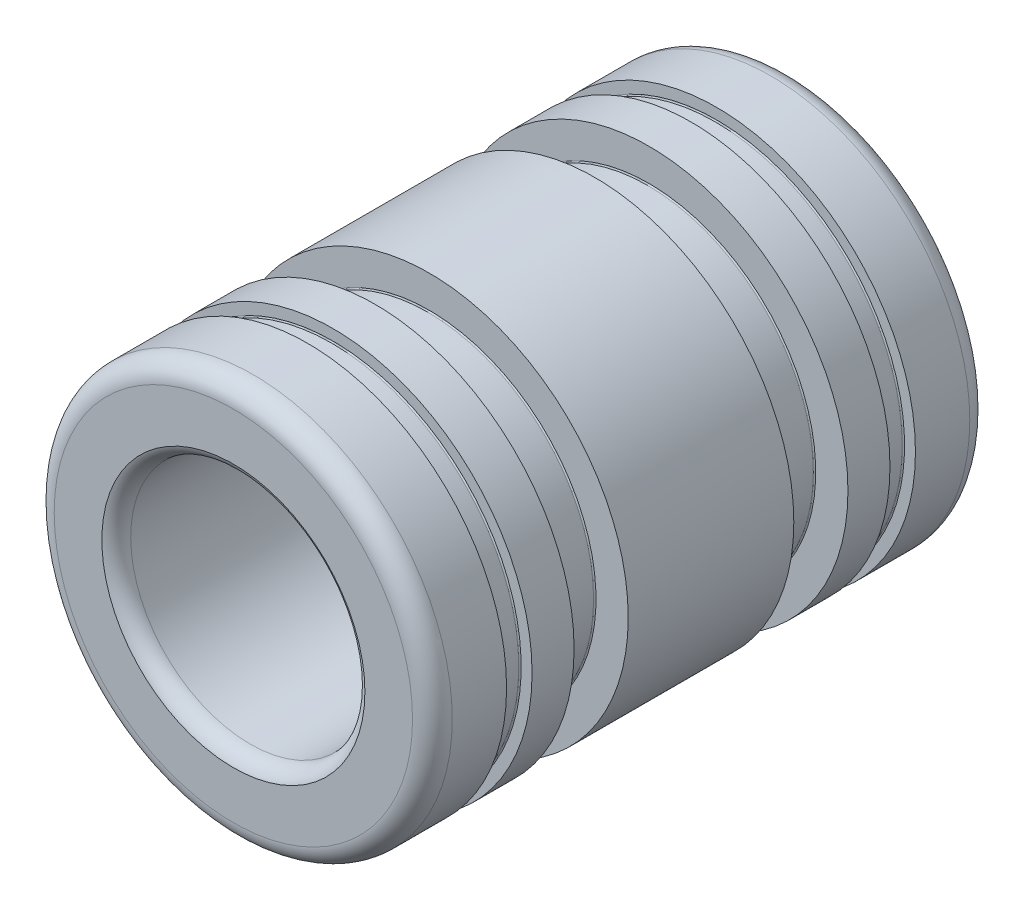
ISO-10303-21;
HEADER;
FILE_DESCRIPTION(('STEP AP214'),'2;1');
FILE_NAME('part.step','',(''),(''),'','','');
FILE_SCHEMA(('AUTOMOTIVE_DESIGN { 1 0 10303 214 1 1 1 1 }'));
ENDSEC;
DATA;
#1=APPLICATION_CONTEXT('core data for automotive mechanical design processes');
#2=APPLICATION_PROTOCOL_DEFINITION('international standard','automotive_design',2000,#1);
#3=PRODUCT_CONTEXT('',#1,'mechanical');
#4=PRODUCT('Part','Part','',(#3));
#5=PRODUCT_RELATED_PRODUCT_CATEGORY('part','',(#4));
#6=PRODUCT_DEFINITION_FORMATION('','',#4);
#7=PRODUCT_DEFINITION_CONTEXT('part definition',#1,'design');
#8=PRODUCT_DEFINITION('design','',#6,#7);
#9=PRODUCT_DEFINITION_SHAPE('','',#8);
#10=(LENGTH_UNIT() NAMED_UNIT(*) SI_UNIT(.MILLI.,.METRE.));
#11=(NAMED_UNIT(*) PLANE_ANGLE_UNIT() SI_UNIT($,.RADIAN.));
#12=(NAMED_UNIT(*) SI_UNIT($,.STERADIAN.) SOLID_ANGLE_UNIT());
#13=UNCERTAINTY_MEASURE_WITH_UNIT(LENGTH_MEASURE(1.E-05),#10,'distance_accuracy_value','');
#14=(GEOMETRIC_REPRESENTATION_CONTEXT(3) GLOBAL_UNCERTAINTY_ASSIGNED_CONTEXT((#13)) GLOBAL_UNIT_ASSIGNED_CONTEXT((#10,
#11,#12)) REPRESENTATION_CONTEXT('',''));
#15=CARTESIAN_POINT('',(0.,0.,0.));
#16=DIRECTION('',(0.,0.,1.));
#17=DIRECTION('',(1.,0.,0.));
#18=AXIS2_PLACEMENT_3D('',#15,#16,#17);
#19=CARTESIAN_POINT('',(0.,0.,-10.4380827653077));
#20=DIRECTION('',(0.,0.,1.));
#21=DIRECTION('',(1.,0.,0.));
#22=AXIS2_PLACEMENT_3D('',#19,#20,#21);
#23=TOROIDAL_SURFACE('',#22,5.4841775,0.7153275);
#24=CARTESIAN_POINT('',(0.,0.,-11.1125));
#25=DIRECTION('',(0.,0.,1.));
#26=DIRECTION('',(1.,0.,0.));
#27=AXIS2_PLACEMENT_3D('',#24,#25,#26);
#28=CIRCLE('',#27,5.245735);
#29=CARTESIAN_POINT('',(5.245735,0.,-11.1125));
#30=VERTEX_POINT('',#29);
#31=EDGE_CURVE('E11',#30,#30,#28,.T.);
#32=ORIENTED_EDGE('',*,*,#31,.F.);
#33=EDGE_LOOP('',(#32));
#34=FACE_BOUND('',#33,.T.);
#35=CARTESIAN_POINT('',(0.,0.,-10.4380827653077));
#36=DIRECTION('',(0.,0.,1.));
#37=DIRECTION('',(1.,0.,0.));
#38=AXIS2_PLACEMENT_3D('',#35,#36,#37);
#39=CIRCLE('',#38,4.76885);
#40=CARTESIAN_POINT('',(4.76885,0.,-10.4380827653077));
#41=VERTEX_POINT('',#40);
#42=EDGE_CURVE('E57',#41,#41,#39,.T.);
#43=ORIENTED_EDGE('',*,*,#42,.T.);
#44=EDGE_LOOP('',(#43));
#45=FACE_BOUND('',#44,.T.);
#46=ADVANCED_FACE('F51',(#34,#45),#23,.T.);
#47=CARTESIAN_POINT('',(0.,0.,11.1125));
#48=DIRECTION('',(0.,0.,1.));
#49=DIRECTION('',(1.,0.,0.));
#50=AXIS2_PLACEMENT_3D('',#47,#48,#49);
#51=CYLINDRICAL_SURFACE('',#50,4.76885);
#52=ORIENTED_EDGE('',*,*,#42,.F.);
#53=EDGE_LOOP('',(#52));
#54=FACE_BOUND('',#53,.T.);
#55=CARTESIAN_POINT('',(0.,0.,10.4380827653077));
#56=DIRECTION('',(0.,0.,1.));
#57=DIRECTION('',(1.,0.,0.));
#58=AXIS2_PLACEMENT_3D('',#55,#56,#57);
#59=CIRCLE('',#58,4.76885);
#60=CARTESIAN_POINT('',(4.76885,0.,10.4380827653077));
#61=VERTEX_POINT('',#60);
#62=EDGE_CURVE('E61',#61,#61,#59,.T.);
#63=ORIENTED_EDGE('',*,*,#62,.T.);
#64=EDGE_LOOP('',(#63));
#65=FACE_BOUND('',#64,.T.);
#66=ADVANCED_FACE('F79',(#54,#65),#51,.F.);
#67=CARTESIAN_POINT('',(0.,0.,10.4380827653077));
#68=DIRECTION('',(0.,0.,1.));
#69=DIRECTION('',(1.,0.,0.));
#70=AXIS2_PLACEMENT_3D('',#67,#68,#69);
#71=TOROIDAL_SURFACE('',#70,5.4841775,0.7153275);
#72=ORIENTED_EDGE('',*,*,#62,.F.);
#73=EDGE_LOOP('',(#72));
#74=FACE_BOUND('',#73,.T.);
#75=CARTESIAN_POINT('',(0.,0.,11.1125));
#76=DIRECTION('',(0.,0.,1.));
#77=DIRECTION('',(1.,0.,0.));
#78=AXIS2_PLACEMENT_3D('',#75,#76,#77);
#79=CIRCLE('',#78,5.245735);
#80=CARTESIAN_POINT('',(5.245735,0.,11.1125));
#81=VERTEX_POINT('',#80);
#82=EDGE_CURVE('E65',#81,#81,#79,.T.);
#83=ORIENTED_EDGE('',*,*,#82,.T.);
#84=EDGE_LOOP('',(#83));
#85=FACE_BOUND('',#84,.T.);
#86=ADVANCED_FACE('F71',(#74,#85),#71,.T.);
#87=CARTESIAN_POINT('',(0.,0.,11.1125));
#88=DIRECTION('',(0.,0.,1.));
#89=DIRECTION('',(1.,0.,0.));
#90=AXIS2_PLACEMENT_3D('',#87,#88,#89);
#91=CYLINDRICAL_SURFACE('',#90,5.245735);
#92=ORIENTED_EDGE('',*,*,#82,.F.);
#93=EDGE_LOOP('',(#92));
#94=FACE_BOUND('',#93,.T.);
#95=ORIENTED_EDGE('',*,*,#31,.T.);
#96=EDGE_LOOP('',(#95));
#97=FACE_BOUND('',#96,.T.);
#98=ADVANCED_FACE('F73',(#94,#97),#91,.T.);
#99=CLOSED_SHELL('',(#46,#66,#86,#98));
#100=MANIFOLD_SOLID_BREP('B2',#99);
#101=CARTESIAN_POINT('',(0.,7.9375,11.1125));
#102=DIRECTION('',(0.,0.,-1.));
#103=DIRECTION('',(-1.,0.,0.));
#104=AXIS2_PLACEMENT_3D('',#101,#102,#103);
#105=PLANE('',#104);
#106=CARTESIAN_POINT('',(0.,0.,11.1125));
#107=DIRECTION('',(0.,0.,-1.));
#108=DIRECTION('',(-1.,0.,0.));
#109=AXIS2_PLACEMENT_3D('',#106,#107,#108);
#110=CIRCLE('',#109,7.1453375);
#111=CARTESIAN_POINT('',(-7.1453375,0.,11.1125));
#112=VERTEX_POINT('',#111);
#113=EDGE_CURVE('E184',#112,#112,#110,.F.);
#114=ORIENTED_EDGE('',*,*,#113,.T.);
#115=EDGE_LOOP('',(#114));
#116=FACE_BOUND('',#115,.T.);
#117=CARTESIAN_POINT('',(0.,0.,11.1125));
#118=DIRECTION('',(0.,0.,1.));
#119=DIRECTION('',(1.,0.,0.));
#120=AXIS2_PLACEMENT_3D('',#117,#118,#119);
#121=CIRCLE('',#120,5.245735);
#122=CARTESIAN_POINT('',(5.245735,0.,11.1125));
#123=VERTEX_POINT('',#122);
#124=EDGE_CURVE('E196',#123,#123,#121,.T.);
#125=ORIENTED_EDGE('',*,*,#124,.F.);
#126=EDGE_LOOP('',(#125));
#127=FACE_BOUND('',#126,.T.);
#128=ADVANCED_FACE('F108',(#116,#127),#105,.F.);
#129=CARTESIAN_POINT('',(0.,0.,11.1125));
#130=DIRECTION('',(0.,0.,1.));
#131=DIRECTION('',(1.,0.,0.));
#132=AXIS2_PLACEMENT_3D('',#129,#130,#131);
#133=CYLINDRICAL_SURFACE('',#132,5.245735);
#134=CARTESIAN_POINT('',(0.,0.,-11.1125));
#135=DIRECTION('',(0.,0.,1.));
#136=DIRECTION('',(1.,0.,0.));
#137=AXIS2_PLACEMENT_3D('',#134,#135,#136);
#138=CIRCLE('',#137,5.245735);
#139=CARTESIAN_POINT('',(5.245735,0.,-11.1125));
#140=VERTEX_POINT('',#139);
#141=EDGE_CURVE('E200',#140,#140,#138,.T.);
#142=ORIENTED_EDGE('',*,*,#141,.F.);
#143=EDGE_LOOP('',(#142));
#144=FACE_BOUND('',#143,.T.);
#145=ORIENTED_EDGE('',*,*,#124,.T.);
#146=EDGE_LOOP('',(#145));
#147=FACE_BOUND('',#146,.T.);
#148=ADVANCED_FACE('F255',(#144,#147),#133,.F.);
#149=CARTESIAN_POINT('',(0.,7.9375,-11.1125));
#150=DIRECTION('',(0.,0.,1.));
#151=DIRECTION('',(1.,0.,0.));
#152=AXIS2_PLACEMENT_3D('',#149,#150,#151);
#153=PLANE('',#152);
#154=CARTESIAN_POINT('',(0.,0.,-11.1125));
#155=DIRECTION('',(0.,0.,1.));
#156=DIRECTION('',(1.,0.,0.));
#157=AXIS2_PLACEMENT_3D('',#154,#155,#156);
#158=CIRCLE('',#157,7.1453375);
#159=CARTESIAN_POINT('',(7.1453375,0.,-11.1125));
#160=VERTEX_POINT('',#159);
#161=EDGE_CURVE('E188',#160,#160,#158,.F.);
#162=ORIENTED_EDGE('',*,*,#161,.T.);
#163=EDGE_LOOP('',(#162));
#164=FACE_BOUND('',#163,.T.);
#165=ORIENTED_EDGE('',*,*,#141,.T.);
#166=EDGE_LOOP('',(#165));
#167=FACE_BOUND('',#166,.T.);
#168=ADVANCED_FACE('F263',(#164,#167),#153,.F.);
#169=CARTESIAN_POINT('',(0.,0.,11.1125));
#170=DIRECTION('',(0.,0.,1.));
#171=DIRECTION('',(1.,0.,0.));
#172=AXIS2_PLACEMENT_3D('',#169,#170,#171);
#173=CYLINDRICAL_SURFACE('',#172,7.9375);
#174=CARTESIAN_POINT('',(0.,0.,-10.3203375));
#175=DIRECTION('',(0.,0.,1.));
#176=DIRECTION('',(1.,0.,0.));
#177=AXIS2_PLACEMENT_3D('',#174,#175,#176);
#178=CIRCLE('',#177,7.9375);
#179=CARTESIAN_POINT('',(7.9375,0.,-10.3203375));
#180=VERTEX_POINT('',#179);
#181=EDGE_CURVE('E192',#180,#180,#178,.T.);
#182=ORIENTED_EDGE('',*,*,#181,.T.);
#183=EDGE_LOOP('',(#182));
#184=FACE_BOUND('',#183,.T.);
#185=CARTESIAN_POINT('',(0.,0.,-8.1534));
#186=DIRECTION('',(0.,0.,1.));
#187=DIRECTION('',(1.,0.,0.));
#188=AXIS2_PLACEMENT_3D('',#185,#186,#187);
#189=CIRCLE('',#188,7.9375);
#190=CARTESIAN_POINT('',(7.9375,0.,-8.1534));
#191=VERTEX_POINT('',#190);
#192=EDGE_CURVE('E204',#191,#191,#189,.T.);
#193=ORIENTED_EDGE('',*,*,#192,.F.);
#194=EDGE_LOOP('',(#193));
#195=FACE_BOUND('',#194,.T.);
#196=ADVANCED_FACE('F458',(#184,#195),#173,.T.);
#197=CARTESIAN_POINT('',(0.,7.9375,-8.1534));
#198=DIRECTION('',(0.,0.,-1.));
#199=DIRECTION('',(-1.,0.,0.));
#200=AXIS2_PLACEMENT_3D('',#197,#198,#199);
#201=PLANE('',#200);
#202=CARTESIAN_POINT('',(0.,0.,-8.1534));
#203=DIRECTION('',(0.,0.,-1.));
#204=DIRECTION('',(-1.,0.,0.));
#205=AXIS2_PLACEMENT_3D('',#202,#203,#204);
#206=CIRCLE('',#205,7.50316);
#207=CARTESIAN_POINT('',(-7.50316,0.,-8.1534));
#208=VERTEX_POINT('',#207);
#209=EDGE_CURVE('E136',#208,#208,#206,.T.);
#210=ORIENTED_EDGE('',*,*,#209,.T.);
#211=EDGE_LOOP('',(#210));
#212=FACE_BOUND('',#211,.T.);
#213=ORIENTED_EDGE('',*,*,#192,.T.);
#214=EDGE_LOOP('',(#213));
#215=FACE_BOUND('',#214,.T.);
#216=ADVANCED_FACE('F451',(#212,#215),#201,.F.);
#217=CARTESIAN_POINT('',(0.,0.,11.1125));
#218=DIRECTION('',(0.,0.,1.));
#219=DIRECTION('',(1.,0.,0.));
#220=AXIS2_PLACEMENT_3D('',#217,#218,#219);
#221=CYLINDRICAL_SURFACE('',#220,7.4549);
#222=CARTESIAN_POINT('',(0.,0.,-8.10514));
#223=DIRECTION('',(0.,0.,-1.));
#224=DIRECTION('',(-1.,0.,0.));
#225=AXIS2_PLACEMENT_3D('',#222,#223,#224);
#226=CIRCLE('',#225,7.4549);
#227=CARTESIAN_POINT('',(-7.4549,0.,-8.10514));
#228=VERTEX_POINT('',#227);
#229=EDGE_CURVE('E140',#228,#228,#226,.F.);
#230=ORIENTED_EDGE('',*,*,#229,.T.);
#231=EDGE_LOOP('',(#230));
#232=FACE_BOUND('',#231,.T.);
#233=CARTESIAN_POINT('',(0.,0.,-7.18566));
#234=DIRECTION('',(0.,0.,1.));
#235=DIRECTION('',(1.,0.,0.));
#236=AXIS2_PLACEMENT_3D('',#233,#234,#235);
#237=CIRCLE('',#236,7.4549);
#238=CARTESIAN_POINT('',(7.4549,0.,-7.18566));
#239=VERTEX_POINT('',#238);
#240=EDGE_CURVE('E144',#239,#239,#237,.F.);
#241=ORIENTED_EDGE('',*,*,#240,.T.);
#242=EDGE_LOOP('',(#241));
#243=FACE_BOUND('',#242,.T.);
#244=ADVANCED_FACE('F443',(#232,#243),#221,.T.);
#245=CARTESIAN_POINT('',(0.,7.4549,-7.1374));
#246=DIRECTION('',(0.,0.,1.));
#247=DIRECTION('',(1.,0.,0.));
#248=AXIS2_PLACEMENT_3D('',#245,#246,#247);
#249=PLANE('',#248);
#250=CARTESIAN_POINT('',(0.,0.,-7.1374));
#251=DIRECTION('',(0.,0.,1.));
#252=DIRECTION('',(1.,0.,0.));
#253=AXIS2_PLACEMENT_3D('',#250,#251,#252);
#254=CIRCLE('',#253,7.50316);
#255=CARTESIAN_POINT('',(7.50316,0.,-7.1374));
#256=VERTEX_POINT('',#255);
#257=EDGE_CURVE('E132',#256,#256,#254,.T.);
#258=ORIENTED_EDGE('',*,*,#257,.T.);
#259=EDGE_LOOP('',(#258));
#260=FACE_BOUND('',#259,.T.);
#261=CARTESIAN_POINT('',(0.,0.,-7.1374));
#262=DIRECTION('',(0.,0.,1.));
#263=DIRECTION('',(1.,0.,0.));
#264=AXIS2_PLACEMENT_3D('',#261,#262,#263);
#265=CIRCLE('',#264,7.9375);
#266=CARTESIAN_POINT('',(7.9375,0.,-7.1374));
#267=VERTEX_POINT('',#266);
#268=EDGE_CURVE('E208',#267,#267,#265,.T.);
#269=ORIENTED_EDGE('',*,*,#268,.F.);
#270=EDGE_LOOP('',(#269));
#271=FACE_BOUND('',#270,.T.);
#272=ADVANCED_FACE('F436',(#260,#271),#249,.F.);
#273=CARTESIAN_POINT('',(0.,0.,11.1125));
#274=DIRECTION('',(0.,0.,1.));
#275=DIRECTION('',(1.,0.,0.));
#276=AXIS2_PLACEMENT_3D('',#273,#274,#275);
#277=CYLINDRICAL_SURFACE('',#276,7.9375);
#278=CARTESIAN_POINT('',(0.,0.,-5.461));
#279=DIRECTION('',(0.,0.,1.));
#280=DIRECTION('',(1.,0.,0.));
#281=AXIS2_PLACEMENT_3D('',#278,#279,#280);
#282=CIRCLE('',#281,7.9375);
#283=CARTESIAN_POINT('',(7.9375,0.,-5.461));
#284=VERTEX_POINT('',#283);
#285=EDGE_CURVE('E212',#284,#284,#282,.T.);
#286=ORIENTED_EDGE('',*,*,#285,.F.);
#287=EDGE_LOOP('',(#286));
#288=FACE_BOUND('',#287,.T.);
#289=ORIENTED_EDGE('',*,*,#268,.T.);
#290=EDGE_LOOP('',(#289));
#291=FACE_BOUND('',#290,.T.);
#292=ADVANCED_FACE('F428',(#288,#291),#277,.T.);
#293=CARTESIAN_POINT('',(0.,7.9375,-5.461));
#294=DIRECTION('',(0.,0.,-1.));
#295=DIRECTION('',(-1.,0.,0.));
#296=AXIS2_PLACEMENT_3D('',#293,#294,#295);
#297=PLANE('',#296);
#298=CARTESIAN_POINT('',(0.,0.,-5.461));
#299=DIRECTION('',(0.,0.,-1.));
#300=DIRECTION('',(-1.,0.,0.));
#301=AXIS2_PLACEMENT_3D('',#298,#299,#300);
#302=CIRCLE('',#301,6.65226);
#303=CARTESIAN_POINT('',(-6.65226,0.,-5.461));
#304=VERTEX_POINT('',#303);
#305=EDGE_CURVE('E152',#304,#304,#302,.T.);
#306=ORIENTED_EDGE('',*,*,#305,.T.);
#307=EDGE_LOOP('',(#306));
#308=FACE_BOUND('',#307,.T.);
#309=ORIENTED_EDGE('',*,*,#285,.T.);
#310=EDGE_LOOP('',(#309));
#311=FACE_BOUND('',#310,.T.);
#312=ADVANCED_FACE('F420',(#308,#311),#297,.F.);
#313=CARTESIAN_POINT('',(0.,0.,11.1125));
#314=DIRECTION('',(0.,0.,1.));
#315=DIRECTION('',(1.,0.,0.));
#316=AXIS2_PLACEMENT_3D('',#313,#314,#315);
#317=CYLINDRICAL_SURFACE('',#316,6.604);
#318=CARTESIAN_POINT('',(0.,0.,-5.41274));
#319=DIRECTION('',(0.,0.,-1.));
#320=DIRECTION('',(-1.,0.,0.));
#321=AXIS2_PLACEMENT_3D('',#318,#319,#320);
#322=CIRCLE('',#321,6.604);
#323=CARTESIAN_POINT('',(-6.604,0.,-5.41274));
#324=VERTEX_POINT('',#323);
#325=EDGE_CURVE('E156',#324,#324,#322,.F.);
#326=ORIENTED_EDGE('',*,*,#325,.T.);
#327=EDGE_LOOP('',(#326));
#328=FACE_BOUND('',#327,.T.);
#329=CARTESIAN_POINT('',(0.,0.,-3.35026));
#330=DIRECTION('',(0.,0.,1.));
#331=DIRECTION('',(1.,0.,0.));
#332=AXIS2_PLACEMENT_3D('',#329,#330,#331);
#333=CIRCLE('',#332,6.604);
#334=CARTESIAN_POINT('',(6.604,0.,-3.35026));
#335=VERTEX_POINT('',#334);
#336=EDGE_CURVE('E160',#335,#335,#333,.F.);
#337=ORIENTED_EDGE('',*,*,#336,.T.);
#338=EDGE_LOOP('',(#337));
#339=FACE_BOUND('',#338,.T.);
#340=ADVANCED_FACE('F412',(#328,#339),#317,.T.);
#341=CARTESIAN_POINT('',(0.,6.604,-3.302));
#342=DIRECTION('',(0.,0.,1.));
#343=DIRECTION('',(1.,0.,0.));
#344=AXIS2_PLACEMENT_3D('',#341,#342,#343);
#345=PLANE('',#344);
#346=CARTESIAN_POINT('',(0.,0.,-3.302));
#347=DIRECTION('',(0.,0.,1.));
#348=DIRECTION('',(1.,0.,0.));
#349=AXIS2_PLACEMENT_3D('',#346,#347,#348);
#350=CIRCLE('',#349,6.65226);
#351=CARTESIAN_POINT('',(6.65226,0.,-3.302));
#352=VERTEX_POINT('',#351);
#353=EDGE_CURVE('E148',#352,#352,#350,.T.);
#354=ORIENTED_EDGE('',*,*,#353,.T.);
#355=EDGE_LOOP('',(#354));
#356=FACE_BOUND('',#355,.T.);
#357=CARTESIAN_POINT('',(0.,0.,-3.302));
#358=DIRECTION('',(0.,0.,1.));
#359=DIRECTION('',(1.,0.,0.));
#360=AXIS2_PLACEMENT_3D('',#357,#358,#359);
#361=CIRCLE('',#360,7.9375);
#362=CARTESIAN_POINT('',(7.9375,0.,-3.302));
#363=VERTEX_POINT('',#362);
#364=EDGE_CURVE('E216',#363,#363,#361,.T.);
#365=ORIENTED_EDGE('',*,*,#364,.F.);
#366=EDGE_LOOP('',(#365));
#367=FACE_BOUND('',#366,.T.);
#368=ADVANCED_FACE('F404',(#356,#367),#345,.F.);
#369=CARTESIAN_POINT('',(0.,0.,11.1125));
#370=DIRECTION('',(0.,0.,1.));
#371=DIRECTION('',(1.,0.,0.));
#372=AXIS2_PLACEMENT_3D('',#369,#370,#371);
#373=CYLINDRICAL_SURFACE('',#372,7.9375);
#374=CARTESIAN_POINT('',(0.,0.,3.302));
#375=DIRECTION('',(0.,0.,1.));
#376=DIRECTION('',(1.,0.,0.));
#377=AXIS2_PLACEMENT_3D('',#374,#375,#376);
#378=CIRCLE('',#377,7.9375);
#379=CARTESIAN_POINT('',(7.9375,0.,3.302));
#380=VERTEX_POINT('',#379);
#381=EDGE_CURVE('E220',#380,#380,#378,.T.);
#382=ORIENTED_EDGE('',*,*,#381,.F.);
#383=EDGE_LOOP('',(#382));
#384=FACE_BOUND('',#383,.T.);
#385=ORIENTED_EDGE('',*,*,#364,.T.);
#386=EDGE_LOOP('',(#385));
#387=FACE_BOUND('',#386,.T.);
#388=ADVANCED_FACE('F396',(#384,#387),#373,.T.);
#389=CARTESIAN_POINT('',(0.,6.604,3.302));
#390=DIRECTION('',(0.,0.,-1.));
#391=DIRECTION('',(-1.,0.,0.));
#392=AXIS2_PLACEMENT_3D('',#389,#390,#391);
#393=PLANE('',#392);
#394=CARTESIAN_POINT('',(0.,0.,3.302));
#395=DIRECTION('',(0.,0.,-1.));
#396=DIRECTION('',(-1.,0.,0.));
#397=AXIS2_PLACEMENT_3D('',#394,#395,#396);
#398=CIRCLE('',#397,6.65226);
#399=CARTESIAN_POINT('',(-6.65226,0.,3.302));
#400=VERTEX_POINT('',#399);
#401=EDGE_CURVE('E168',#400,#400,#398,.T.);
#402=ORIENTED_EDGE('',*,*,#401,.T.);
#403=EDGE_LOOP('',(#402));
#404=FACE_BOUND('',#403,.T.);
#405=ORIENTED_EDGE('',*,*,#381,.T.);
#406=EDGE_LOOP('',(#405));
#407=FACE_BOUND('',#406,.T.);
#408=ADVANCED_FACE('F388',(#404,#407),#393,.F.);
#409=CARTESIAN_POINT('',(0.,0.,11.1125));
#410=DIRECTION('',(0.,0.,1.));
#411=DIRECTION('',(1.,0.,0.));
#412=AXIS2_PLACEMENT_3D('',#409,#410,#411);
#413=CYLINDRICAL_SURFACE('',#412,6.604);
#414=CARTESIAN_POINT('',(0.,0.,3.35026));
#415=DIRECTION('',(0.,0.,-1.));
#416=DIRECTION('',(-1.,0.,0.));
#417=AXIS2_PLACEMENT_3D('',#414,#415,#416);
#418=CIRCLE('',#417,6.604);
#419=CARTESIAN_POINT('',(-6.604,0.,3.35026));
#420=VERTEX_POINT('',#419);
#421=EDGE_CURVE('E172',#420,#420,#418,.F.);
#422=ORIENTED_EDGE('',*,*,#421,.T.);
#423=EDGE_LOOP('',(#422));
#424=FACE_BOUND('',#423,.T.);
#425=CARTESIAN_POINT('',(0.,0.,5.41274));
#426=DIRECTION('',(0.,0.,1.));
#427=DIRECTION('',(1.,0.,0.));
#428=AXIS2_PLACEMENT_3D('',#425,#426,#427);
#429=CIRCLE('',#428,6.604);
#430=CARTESIAN_POINT('',(6.604,0.,5.41274));
#431=VERTEX_POINT('',#430);
#432=EDGE_CURVE('E176',#431,#431,#429,.F.);
#433=ORIENTED_EDGE('',*,*,#432,.T.);
#434=EDGE_LOOP('',(#433));
#435=FACE_BOUND('',#434,.T.);
#436=ADVANCED_FACE('F380',(#424,#435),#413,.T.);
#437=CARTESIAN_POINT('',(0.,7.9375,5.461));
#438=DIRECTION('',(0.,0.,1.));
#439=DIRECTION('',(1.,0.,0.));
#440=AXIS2_PLACEMENT_3D('',#437,#438,#439);
#441=PLANE('',#440);
#442=CARTESIAN_POINT('',(0.,0.,5.461));
#443=DIRECTION('',(0.,0.,1.));
#444=DIRECTION('',(1.,0.,0.));
#445=AXIS2_PLACEMENT_3D('',#442,#443,#444);
#446=CIRCLE('',#445,6.65226);
#447=CARTESIAN_POINT('',(6.65226,0.,5.461));
#448=VERTEX_POINT('',#447);
#449=EDGE_CURVE('E164',#448,#448,#446,.T.);
#450=ORIENTED_EDGE('',*,*,#449,.T.);
#451=EDGE_LOOP('',(#450));
#452=FACE_BOUND('',#451,.T.);
#453=CARTESIAN_POINT('',(0.,0.,5.461));
#454=DIRECTION('',(0.,0.,1.));
#455=DIRECTION('',(1.,0.,0.));
#456=AXIS2_PLACEMENT_3D('',#453,#454,#455);
#457=CIRCLE('',#456,7.9375);
#458=CARTESIAN_POINT('',(7.9375,0.,5.461));
#459=VERTEX_POINT('',#458);
#460=EDGE_CURVE('E224',#459,#459,#457,.T.);
#461=ORIENTED_EDGE('',*,*,#460,.F.);
#462=EDGE_LOOP('',(#461));
#463=FACE_BOUND('',#462,.T.);
#464=ADVANCED_FACE('F372',(#452,#463),#441,.F.);
#465=CARTESIAN_POINT('',(0.,0.,11.1125));
#466=DIRECTION('',(0.,0.,1.));
#467=DIRECTION('',(1.,0.,0.));
#468=AXIS2_PLACEMENT_3D('',#465,#466,#467);
#469=CYLINDRICAL_SURFACE('',#468,7.9375);
#470=CARTESIAN_POINT('',(0.,0.,7.1374));
#471=DIRECTION('',(0.,0.,1.));
#472=DIRECTION('',(1.,0.,0.));
#473=AXIS2_PLACEMENT_3D('',#470,#471,#472);
#474=CIRCLE('',#473,7.9375);
#475=CARTESIAN_POINT('',(7.9375,0.,7.1374));
#476=VERTEX_POINT('',#475);
#477=EDGE_CURVE('E228',#476,#476,#474,.T.);
#478=ORIENTED_EDGE('',*,*,#477,.F.);
#479=EDGE_LOOP('',(#478));
#480=FACE_BOUND('',#479,.T.);
#481=ORIENTED_EDGE('',*,*,#460,.T.);
#482=EDGE_LOOP('',(#481));
#483=FACE_BOUND('',#482,.T.);
#484=ADVANCED_FACE('F365',(#480,#483),#469,.T.);
#485=CARTESIAN_POINT('',(0.,7.4549,7.1374));
#486=DIRECTION('',(0.,0.,-1.));
#487=DIRECTION('',(-1.,0.,0.));
#488=AXIS2_PLACEMENT_3D('',#485,#486,#487);
#489=PLANE('',#488);
#490=CARTESIAN_POINT('',(0.,0.,7.1374));
#491=DIRECTION('',(0.,0.,-1.));
#492=DIRECTION('',(-1.,0.,0.));
#493=AXIS2_PLACEMENT_3D('',#490,#491,#492);
#494=CIRCLE('',#493,7.50316);
#495=CARTESIAN_POINT('',(-7.50316,0.,7.1374));
#496=VERTEX_POINT('',#495);
#497=EDGE_CURVE('E116',#496,#496,#494,.T.);
#498=ORIENTED_EDGE('',*,*,#497,.T.);
#499=EDGE_LOOP('',(#498));
#500=FACE_BOUND('',#499,.T.);
#501=ORIENTED_EDGE('',*,*,#477,.T.);
#502=EDGE_LOOP('',(#501));
#503=FACE_BOUND('',#502,.T.);
#504=ADVANCED_FACE('F251',(#500,#503),#489,.F.);
#505=CARTESIAN_POINT('',(0.,0.,11.1125));
#506=DIRECTION('',(0.,0.,1.));
#507=DIRECTION('',(1.,0.,0.));
#508=AXIS2_PLACEMENT_3D('',#505,#506,#507);
#509=CYLINDRICAL_SURFACE('',#508,7.4549);
#510=CARTESIAN_POINT('',(0.,0.,7.18566));
#511=DIRECTION('',(0.,0.,-1.));
#512=DIRECTION('',(-1.,0.,0.));
#513=AXIS2_PLACEMENT_3D('',#510,#511,#512);
#514=CIRCLE('',#513,7.4549);
#515=CARTESIAN_POINT('',(-7.4549,0.,7.18566));
#516=VERTEX_POINT('',#515);
#517=EDGE_CURVE('E121',#516,#516,#514,.F.);
#518=ORIENTED_EDGE('',*,*,#517,.T.);
#519=EDGE_LOOP('',(#518));
#520=FACE_BOUND('',#519,.T.);
#521=CARTESIAN_POINT('',(0.,0.,8.10514));
#522=DIRECTION('',(0.,0.,1.));
#523=DIRECTION('',(1.,0.,0.));
#524=AXIS2_PLACEMENT_3D('',#521,#522,#523);
#525=CIRCLE('',#524,7.4549);
#526=CARTESIAN_POINT('',(7.4549,0.,8.10514));
#527=VERTEX_POINT('',#526);
#528=EDGE_CURVE('E126',#527,#527,#525,.F.);
#529=ORIENTED_EDGE('',*,*,#528,.T.);
#530=EDGE_LOOP('',(#529));
#531=FACE_BOUND('',#530,.T.);
#532=ADVANCED_FACE('F241',(#520,#531),#509,.T.);
#533=CARTESIAN_POINT('',(0.,7.9375,8.1534));
#534=DIRECTION('',(0.,0.,1.));
#535=DIRECTION('',(1.,0.,0.));
#536=AXIS2_PLACEMENT_3D('',#533,#534,#535);
#537=PLANE('',#536);
#538=CARTESIAN_POINT('',(0.,0.,8.1534));
#539=DIRECTION('',(0.,0.,1.));
#540=DIRECTION('',(1.,0.,0.));
#541=AXIS2_PLACEMENT_3D('',#538,#539,#540);
#542=CIRCLE('',#541,7.50316);
#543=CARTESIAN_POINT('',(7.50316,0.,8.1534));
#544=VERTEX_POINT('',#543);
#545=EDGE_CURVE('E50',#544,#544,#542,.T.);
#546=ORIENTED_EDGE('',*,*,#545,.T.);
#547=EDGE_LOOP('',(#546));
#548=FACE_BOUND('',#547,.T.);
#549=CARTESIAN_POINT('',(0.,0.,8.1534));
#550=DIRECTION('',(0.,0.,1.));
#551=DIRECTION('',(1.,0.,0.));
#552=AXIS2_PLACEMENT_3D('',#549,#550,#551);
#553=CIRCLE('',#552,7.9375);
#554=CARTESIAN_POINT('',(7.9375,0.,8.1534));
#555=VERTEX_POINT('',#554);
#556=EDGE_CURVE('E232',#555,#555,#553,.T.);
#557=ORIENTED_EDGE('',*,*,#556,.F.);
#558=EDGE_LOOP('',(#557));
#559=FACE_BOUND('',#558,.T.);
#560=ADVANCED_FACE('F239',(#548,#559),#537,.F.);
#561=CARTESIAN_POINT('',(0.,0.,11.1125));
#562=DIRECTION('',(0.,0.,1.));
#563=DIRECTION('',(1.,0.,0.));
#564=AXIS2_PLACEMENT_3D('',#561,#562,#563);
#565=CYLINDRICAL_SURFACE('',#564,7.9375);
#566=CARTESIAN_POINT('',(0.,0.,10.3203375));
#567=DIRECTION('',(0.,0.,-1.));
#568=DIRECTION('',(-1.,0.,0.));
#569=AXIS2_PLACEMENT_3D('',#566,#567,#568);
#570=CIRCLE('',#569,7.9375);
#571=CARTESIAN_POINT('',(-7.9375,0.,10.3203375));
#572=VERTEX_POINT('',#571);
#573=EDGE_CURVE('E180',#572,#572,#570,.T.);
#574=ORIENTED_EDGE('',*,*,#573,.T.);
#575=EDGE_LOOP('',(#574));
#576=FACE_BOUND('',#575,.T.);
#577=ORIENTED_EDGE('',*,*,#556,.T.);
#578=EDGE_LOOP('',(#577));
#579=FACE_BOUND('',#578,.T.);
#580=ADVANCED_FACE('F237',(#576,#579),#565,.T.);
#581=CARTESIAN_POINT('',(0.,0.,-10.3203375));
#582=DIRECTION('',(0.,0.,1.));
#583=DIRECTION('',(1.,0.,0.));
#584=AXIS2_PLACEMENT_3D('',#581,#582,#583);
#585=TOROIDAL_SURFACE('',#584,7.1453375,0.7921625);
#586=ORIENTED_EDGE('',*,*,#161,.F.);
#587=EDGE_LOOP('',(#586));
#588=FACE_BOUND('',#587,.T.);
#589=ORIENTED_EDGE('',*,*,#181,.F.);
#590=EDGE_LOOP('',(#589));
#591=FACE_BOUND('',#590,.T.);
#592=ADVANCED_FACE('F248',(#588,#591),#585,.T.);
#593=CARTESIAN_POINT('',(0.,0.,10.3203375));
#594=DIRECTION('',(0.,0.,-1.));
#595=DIRECTION('',(-1.,0.,0.));
#596=AXIS2_PLACEMENT_3D('',#593,#594,#595);
#597=TOROIDAL_SURFACE('',#596,7.1453375,0.7921625);
#598=ORIENTED_EDGE('',*,*,#573,.F.);
#599=EDGE_LOOP('',(#598));
#600=FACE_BOUND('',#599,.T.);
#601=ORIENTED_EDGE('',*,*,#113,.F.);
#602=EDGE_LOOP('',(#601));
#603=FACE_BOUND('',#602,.T.);
#604=ADVANCED_FACE('F271',(#600,#603),#597,.T.);
#605=CARTESIAN_POINT('',(0.,0.,3.35026));
#606=DIRECTION('',(0.,0.,-1.));
#607=DIRECTION('',(-1.,0.,0.));
#608=AXIS2_PLACEMENT_3D('',#605,#606,#607);
#609=TOROIDAL_SURFACE('',#608,6.65226,0.04826);
#610=ORIENTED_EDGE('',*,*,#401,.F.);
#611=EDGE_LOOP('',(#610));
#612=FACE_BOUND('',#611,.T.);
#613=ORIENTED_EDGE('',*,*,#421,.F.);
#614=EDGE_LOOP('',(#613));
#615=FACE_BOUND('',#614,.T.);
#616=ADVANCED_FACE('F275',(#612,#615),#609,.F.);
#617=CARTESIAN_POINT('',(0.,0.,5.41274));
#618=DIRECTION('',(0.,0.,1.));
#619=DIRECTION('',(1.,0.,0.));
#620=AXIS2_PLACEMENT_3D('',#617,#618,#619);
#621=TOROIDAL_SURFACE('',#620,6.65226,0.04826);
#622=ORIENTED_EDGE('',*,*,#432,.F.);
#623=EDGE_LOOP('',(#622));
#624=FACE_BOUND('',#623,.T.);
#625=ORIENTED_EDGE('',*,*,#449,.F.);
#626=EDGE_LOOP('',(#625));
#627=FACE_BOUND('',#626,.T.);
#628=ADVANCED_FACE('F278',(#624,#627),#621,.F.);
#629=CARTESIAN_POINT('',(0.,0.,-5.41274));
#630=DIRECTION('',(0.,0.,-1.));
#631=DIRECTION('',(-1.,0.,0.));
#632=AXIS2_PLACEMENT_3D('',#629,#630,#631);
#633=TOROIDAL_SURFACE('',#632,6.65226,0.04826);
#634=ORIENTED_EDGE('',*,*,#305,.F.);
#635=EDGE_LOOP('',(#634));
#636=FACE_BOUND('',#635,.T.);
#637=ORIENTED_EDGE('',*,*,#325,.F.);
#638=EDGE_LOOP('',(#637));
#639=FACE_BOUND('',#638,.T.);
#640=ADVANCED_FACE('F282',(#636,#639),#633,.F.);
#641=CARTESIAN_POINT('',(0.,0.,-3.35026));
#642=DIRECTION('',(0.,0.,1.));
#643=DIRECTION('',(1.,0.,0.));
#644=AXIS2_PLACEMENT_3D('',#641,#642,#643);
#645=TOROIDAL_SURFACE('',#644,6.65226,0.04826);
#646=ORIENTED_EDGE('',*,*,#336,.F.);
#647=EDGE_LOOP('',(#646));
#648=FACE_BOUND('',#647,.T.);
#649=ORIENTED_EDGE('',*,*,#353,.F.);
#650=EDGE_LOOP('',(#649));
#651=FACE_BOUND('',#650,.T.);
#652=ADVANCED_FACE('F286',(#648,#651),#645,.F.);
#653=CARTESIAN_POINT('',(0.,0.,-8.10514));
#654=DIRECTION('',(0.,0.,-1.));
#655=DIRECTION('',(-1.,0.,0.));
#656=AXIS2_PLACEMENT_3D('',#653,#654,#655);
#657=TOROIDAL_SURFACE('',#656,7.50316,0.04826);
#658=ORIENTED_EDGE('',*,*,#209,.F.);
#659=EDGE_LOOP('',(#658));
#660=FACE_BOUND('',#659,.T.);
#661=ORIENTED_EDGE('',*,*,#229,.F.);
#662=EDGE_LOOP('',(#661));
#663=FACE_BOUND('',#662,.T.);
#664=ADVANCED_FACE('F290',(#660,#663),#657,.F.);
#665=CARTESIAN_POINT('',(0.,0.,-7.18566));
#666=DIRECTION('',(0.,0.,1.));
#667=DIRECTION('',(1.,0.,0.));
#668=AXIS2_PLACEMENT_3D('',#665,#666,#667);
#669=TOROIDAL_SURFACE('',#668,7.50316,0.04826);
#670=ORIENTED_EDGE('',*,*,#240,.F.);
#671=EDGE_LOOP('',(#670));
#672=FACE_BOUND('',#671,.T.);
#673=ORIENTED_EDGE('',*,*,#257,.F.);
#674=EDGE_LOOP('',(#673));
#675=FACE_BOUND('',#674,.T.);
#676=ADVANCED_FACE('F294',(#672,#675),#669,.F.);
#677=CARTESIAN_POINT('',(0.,0.,7.18566));
#678=DIRECTION('',(0.,0.,-1.));
#679=DIRECTION('',(-1.,0.,0.));
#680=AXIS2_PLACEMENT_3D('',#677,#678,#679);
#681=TOROIDAL_SURFACE('',#680,7.50316,0.04826);
#682=ORIENTED_EDGE('',*,*,#497,.F.);
#683=EDGE_LOOP('',(#682));
#684=FACE_BOUND('',#683,.T.);
#685=ORIENTED_EDGE('',*,*,#517,.F.);
#686=EDGE_LOOP('',(#685));
#687=FACE_BOUND('',#686,.T.);
#688=ADVANCED_FACE('F297',(#684,#687),#681,.F.);
#689=CARTESIAN_POINT('',(0.,0.,8.10514));
#690=DIRECTION('',(0.,0.,1.));
#691=DIRECTION('',(1.,0.,0.));
#692=AXIS2_PLACEMENT_3D('',#689,#690,#691);
#693=TOROIDAL_SURFACE('',#692,7.50316,0.04826);
#694=ORIENTED_EDGE('',*,*,#528,.F.);
#695=EDGE_LOOP('',(#694));
#696=FACE_BOUND('',#695,.T.);
#697=ORIENTED_EDGE('',*,*,#545,.F.);
#698=EDGE_LOOP('',(#697));
#699=FACE_BOUND('',#698,.T.);
#700=ADVANCED_FACE('F110',(#696,#699),#693,.F.);
#701=CLOSED_SHELL('',(#128,#148,#168,#196,#216,#244,#272,#292,#312,#340,#368,#388,#408,#436,
#464,#484,#504,#532,#560,#580,#592,#604,#616,#628,#640,#652,#664,#676,#688,#700));
#702=MANIFOLD_SOLID_BREP('B6',#701);
#703=ADVANCED_BREP_SHAPE_REPRESENTATION('',(#18,#100,#702),#14);
#704=SHAPE_DEFINITION_REPRESENTATION(#9,#703);
ENDSEC;
END-ISO-10303-21;
